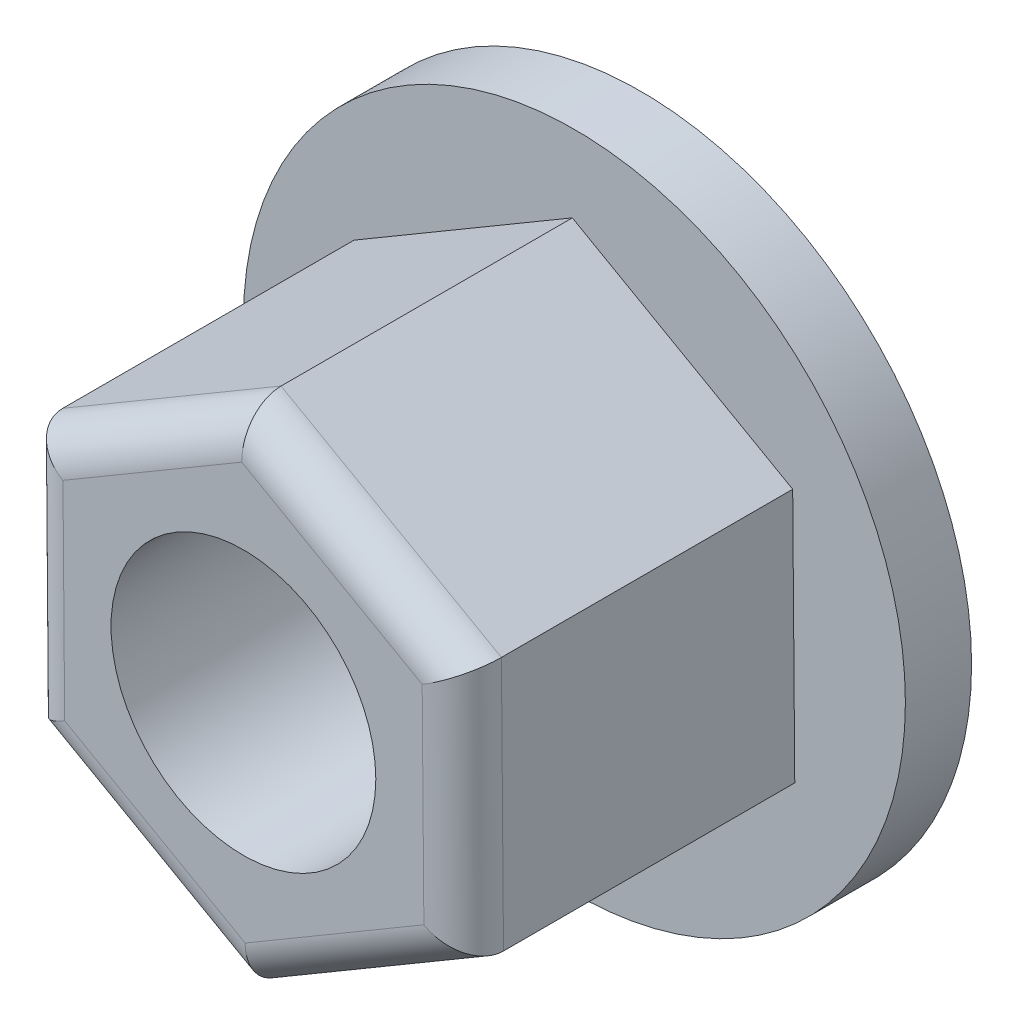
ISO-10303-21;
HEADER;
FILE_DESCRIPTION(('STEP AP214'),'2;1');
FILE_NAME('part.step','',(''),(''),'','','');
FILE_SCHEMA(('AUTOMOTIVE_DESIGN { 1 0 10303 214 1 1 1 1 }'));
ENDSEC;
DATA;
#1=APPLICATION_CONTEXT('core data for automotive mechanical design processes');
#2=APPLICATION_PROTOCOL_DEFINITION('international standard','automotive_design',2000,#1);
#3=PRODUCT_CONTEXT('',#1,'mechanical');
#4=PRODUCT('Part','Part','',(#3));
#5=PRODUCT_RELATED_PRODUCT_CATEGORY('part','',(#4));
#6=PRODUCT_DEFINITION_FORMATION('','',#4);
#7=PRODUCT_DEFINITION_CONTEXT('part definition',#1,'design');
#8=PRODUCT_DEFINITION('design','',#6,#7);
#9=PRODUCT_DEFINITION_SHAPE('','',#8);
#10=(LENGTH_UNIT() NAMED_UNIT(*) SI_UNIT(.MILLI.,.METRE.));
#11=(NAMED_UNIT(*) PLANE_ANGLE_UNIT() SI_UNIT($,.RADIAN.));
#12=(NAMED_UNIT(*) SI_UNIT($,.STERADIAN.) SOLID_ANGLE_UNIT());
#13=UNCERTAINTY_MEASURE_WITH_UNIT(LENGTH_MEASURE(1.E-05),#10,'distance_accuracy_value','');
#14=(GEOMETRIC_REPRESENTATION_CONTEXT(3) GLOBAL_UNCERTAINTY_ASSIGNED_CONTEXT((#13)) GLOBAL_UNIT_ASSIGNED_CONTEXT((#10,
#11,#12)) REPRESENTATION_CONTEXT('',''));
#15=CARTESIAN_POINT('',(0.,0.,0.));
#16=DIRECTION('',(0.,0.,1.));
#17=DIRECTION('',(1.,0.,0.));
#18=AXIS2_PLACEMENT_3D('',#15,#16,#17);
#19=CARTESIAN_POINT('',(0.,0.,5.));
#20=DIRECTION('',(0.,0.,-1.));
#21=DIRECTION('',(-1.,0.,0.));
#22=AXIS2_PLACEMENT_3D('',#19,#20,#21);
#23=CYLINDRICAL_SURFACE('',#22,25.);
#24=CARTESIAN_POINT('',(0.,0.,5.));
#25=DIRECTION('',(0.,0.,1.));
#26=DIRECTION('',(1.,0.,0.));
#27=AXIS2_PLACEMENT_3D('',#24,#25,#26);
#28=CIRCLE('',#27,25.);
#29=CARTESIAN_POINT('',(25.,0.,5.));
#30=VERTEX_POINT('',#29);
#31=EDGE_CURVE('E165',#30,#30,#28,.T.);
#32=ORIENTED_EDGE('',*,*,#31,.F.);
#33=EDGE_LOOP('',(#32));
#34=FACE_BOUND('',#33,.T.);
#35=CARTESIAN_POINT('',(0.,0.,0.));
#36=DIRECTION('',(0.,0.,1.));
#37=DIRECTION('',(1.,0.,0.));
#38=AXIS2_PLACEMENT_3D('',#35,#36,#37);
#39=CIRCLE('',#38,25.);
#40=CARTESIAN_POINT('',(25.,0.,0.));
#41=VERTEX_POINT('',#40);
#42=EDGE_CURVE('E164',#41,#41,#39,.T.);
#43=ORIENTED_EDGE('',*,*,#42,.T.);
#44=EDGE_LOOP('',(#43));
#45=FACE_BOUND('',#44,.T.);
#46=ADVANCED_FACE('F39',(#34,#45),#23,.T.);
#47=CARTESIAN_POINT('',(0.,0.,5.));
#48=DIRECTION('',(0.,0.,1.));
#49=DIRECTION('',(1.,0.,0.));
#50=AXIS2_PLACEMENT_3D('',#47,#48,#49);
#51=PLANE('',#50);
#52=DIRECTION('',(0.861883033836159,0.507107124762981,0.));
#53=VECTOR('',#52,1.);
#54=CARTESIAN_POINT('',(0.15735845395707,-19.1284386722688,5.));
#55=LINE('',#54,#53);
#56=CARTESIAN_POINT('',(0.15735845395707,-19.1284386722688,5.));
#57=VERTEX_POINT('',#56);
#58=CARTESIAN_POINT('',(16.644393051896,-9.42794291750733,5.));
#59=VERTEX_POINT('',#58);
#60=EDGE_CURVE('E135',#57,#59,#55,.T.);
#61=ORIENTED_EDGE('',*,*,#60,.F.);
#62=DIRECTION('',(0.870109169402906,-0.492859040011426,0.));
#63=VECTOR('',#62,1.);
#64=CARTESIAN_POINT('',(-16.4870345979389,-9.70049575476147,5.));
#65=LINE('',#64,#63);
#66=CARTESIAN_POINT('',(-16.4870345979389,-9.70049575476147,5.));
#67=VERTEX_POINT('',#66);
#68=EDGE_CURVE('E147',#67,#57,#65,.T.);
#69=ORIENTED_EDGE('',*,*,#68,.F.);
#70=DIRECTION('',(0.00822613556674694,-0.999966164774408,0.));
#71=VECTOR('',#70,1.);
#72=CARTESIAN_POINT('',(-16.644393051896,9.42794291750733,5.));
#73=LINE('',#72,#71);
#74=CARTESIAN_POINT('',(-16.644393051896,9.42794291750733,5.));
#75=VERTEX_POINT('',#74);
#76=EDGE_CURVE('E143',#75,#67,#73,.T.);
#77=ORIENTED_EDGE('',*,*,#76,.F.);
#78=DIRECTION('',(-0.861883033836159,-0.507107124762981,0.));
#79=VECTOR('',#78,1.);
#80=CARTESIAN_POINT('',(-0.15735845395707,19.1284386722688,5.));
#81=LINE('',#80,#79);
#82=CARTESIAN_POINT('',(-0.15735845395707,19.1284386722688,5.));
#83=VERTEX_POINT('',#82);
#84=EDGE_CURVE('E130',#83,#75,#81,.T.);
#85=ORIENTED_EDGE('',*,*,#84,.F.);
#86=DIRECTION('',(-0.870109169402906,0.492859040011426,0.));
#87=VECTOR('',#86,1.);
#88=CARTESIAN_POINT('',(16.4870345979389,9.70049575476148,5.));
#89=LINE('',#88,#87);
#90=CARTESIAN_POINT('',(16.4870345979389,9.70049575476148,5.));
#91=VERTEX_POINT('',#90);
#92=EDGE_CURVE('E113',#91,#83,#89,.T.);
#93=ORIENTED_EDGE('',*,*,#92,.F.);
#94=DIRECTION('',(-0.0082261355667464,0.999966164774407,0.));
#95=VECTOR('',#94,1.);
#96=CARTESIAN_POINT('',(16.644393051896,-9.42794291750733,5.));
#97=LINE('',#96,#95);
#98=EDGE_CURVE('E126',#59,#91,#97,.T.);
#99=ORIENTED_EDGE('',*,*,#98,.F.);
#100=EDGE_LOOP('',(#61,#69,#77,#85,#93,#99));
#101=FACE_BOUND('',#100,.T.);
#102=ORIENTED_EDGE('',*,*,#31,.T.);
#103=EDGE_LOOP('',(#102));
#104=FACE_BOUND('',#103,.T.);
#105=ADVANCED_FACE('F124',(#101,#104),#51,.T.);
#106=CARTESIAN_POINT('',(0.,0.,0.));
#107=DIRECTION('',(0.,0.,1.));
#108=DIRECTION('',(1.,0.,0.));
#109=AXIS2_PLACEMENT_3D('',#106,#107,#108);
#110=PLANE('',#109);
#111=CARTESIAN_POINT('',(0.,0.,0.));
#112=DIRECTION('',(0.,0.,1.));
#113=DIRECTION('',(1.,0.,0.));
#114=AXIS2_PLACEMENT_3D('',#111,#112,#113);
#115=CIRCLE('',#114,10.);
#116=CARTESIAN_POINT('',(10.,0.,0.));
#117=VERTEX_POINT('',#116);
#118=EDGE_CURVE('E209',#117,#117,#115,.T.);
#119=ORIENTED_EDGE('',*,*,#118,.T.);
#120=EDGE_LOOP('',(#119));
#121=FACE_BOUND('',#120,.T.);
#122=ORIENTED_EDGE('',*,*,#42,.F.);
#123=EDGE_LOOP('',(#122));
#124=FACE_BOUND('',#123,.T.);
#125=ADVANCED_FACE('F276',(#121,#124),#110,.F.);
#126=CARTESIAN_POINT('',(0.15735845395707,-19.1284386722688,30.));
#127=DIRECTION('',(-0.507107124762981,0.861883033836159,0.));
#128=DIRECTION('',(-0.861883033836159,-0.507107124762981,0.));
#129=AXIS2_PLACEMENT_3D('',#126,#127,#128);
#130=PLANE('',#129);
#131=DIRECTION('',(0.,0.,-1.));
#132=VECTOR('',#131,1.);
#133=CARTESIAN_POINT('',(16.644393051896,-9.42794291750733,30.));
#134=LINE('',#133,#132);
#135=CARTESIAN_POINT('',(16.644393051896,-9.42794291750733,27.));
#136=VERTEX_POINT('',#135);
#137=EDGE_CURVE('E117',#136,#59,#134,.T.);
#138=ORIENTED_EDGE('',*,*,#137,.F.);
#139=DIRECTION('',(0.861883033836159,0.507107124762981,0.));
#140=VECTOR('',#139,1.);
#141=CARTESIAN_POINT('',(0.157358453957069,-19.1284386722688,27.));
#142=LINE('',#141,#140);
#143=CARTESIAN_POINT('',(0.15735845395707,-19.1284386722688,27.));
#144=VERTEX_POINT('',#143);
#145=EDGE_CURVE('E11',#136,#144,#142,.F.);
#146=ORIENTED_EDGE('',*,*,#145,.T.);
#147=DIRECTION('',(0.,0.,-1.));
#148=VECTOR('',#147,1.);
#149=CARTESIAN_POINT('',(0.15735845395707,-19.1284386722688,30.));
#150=LINE('',#149,#148);
#151=EDGE_CURVE('E151',#144,#57,#150,.T.);
#152=ORIENTED_EDGE('',*,*,#151,.T.);
#153=ORIENTED_EDGE('',*,*,#60,.T.);
#154=EDGE_LOOP('',(#138,#146,#152,#153));
#155=FACE_BOUND('',#154,.T.);
#156=ADVANCED_FACE('F243',(#155),#130,.F.);
#157=CARTESIAN_POINT('',(16.644393051896,-9.42794291750733,30.));
#158=DIRECTION('',(-0.999966164774407,-0.0082261355667464,0.));
#159=DIRECTION('',(0.0082261355667464,-0.999966164774408,0.));
#160=AXIS2_PLACEMENT_3D('',#157,#158,#159);
#161=PLANE('',#160);
#162=DIRECTION('',(0.,0.,-1.));
#163=VECTOR('',#162,1.);
#164=CARTESIAN_POINT('',(16.4870345979389,9.70049575476148,30.));
#165=LINE('',#164,#163);
#166=CARTESIAN_POINT('',(16.4870345979389,9.70049575476148,27.));
#167=VERTEX_POINT('',#166);
#168=EDGE_CURVE('E110',#167,#91,#165,.T.);
#169=ORIENTED_EDGE('',*,*,#168,.F.);
#170=DIRECTION('',(-0.0082261355667464,0.999966164774408,0.));
#171=VECTOR('',#170,1.);
#172=CARTESIAN_POINT('',(16.644393051896,-9.42794291750733,27.));
#173=LINE('',#172,#171);
#174=EDGE_CURVE('E49',#167,#136,#173,.F.);
#175=ORIENTED_EDGE('',*,*,#174,.T.);
#176=ORIENTED_EDGE('',*,*,#137,.T.);
#177=ORIENTED_EDGE('',*,*,#98,.T.);
#178=EDGE_LOOP('',(#169,#175,#176,#177));
#179=FACE_BOUND('',#178,.T.);
#180=ADVANCED_FACE('F133',(#179),#161,.F.);
#181=CARTESIAN_POINT('',(16.4870345979389,9.70049575476148,30.));
#182=DIRECTION('',(-0.492859040011426,-0.870109169402906,0.));
#183=DIRECTION('',(0.870109169402906,-0.492859040011426,0.));
#184=AXIS2_PLACEMENT_3D('',#181,#182,#183);
#185=PLANE('',#184);
#186=DIRECTION('',(0.,0.,-1.));
#187=VECTOR('',#186,1.);
#188=CARTESIAN_POINT('',(-0.15735845395707,19.1284386722688,30.));
#189=LINE('',#188,#187);
#190=CARTESIAN_POINT('',(-0.15735845395707,19.1284386722688,27.));
#191=VERTEX_POINT('',#190);
#192=EDGE_CURVE('E118',#191,#83,#189,.T.);
#193=ORIENTED_EDGE('',*,*,#192,.F.);
#194=DIRECTION('',(-0.870109169402906,0.492859040011426,0.));
#195=VECTOR('',#194,1.);
#196=CARTESIAN_POINT('',(16.4870345979389,9.70049575476148,27.));
#197=LINE('',#196,#195);
#198=EDGE_CURVE('E64',#191,#167,#197,.F.);
#199=ORIENTED_EDGE('',*,*,#198,.T.);
#200=ORIENTED_EDGE('',*,*,#168,.T.);
#201=ORIENTED_EDGE('',*,*,#92,.T.);
#202=EDGE_LOOP('',(#193,#199,#200,#201));
#203=FACE_BOUND('',#202,.T.);
#204=ADVANCED_FACE('F112',(#203),#185,.F.);
#205=CARTESIAN_POINT('',(-0.15735845395707,19.1284386722688,30.));
#206=DIRECTION('',(0.507107124762981,-0.861883033836159,0.));
#207=DIRECTION('',(0.861883033836159,0.507107124762981,0.));
#208=AXIS2_PLACEMENT_3D('',#205,#206,#207);
#209=PLANE('',#208);
#210=DIRECTION('',(0.,0.,-1.));
#211=VECTOR('',#210,1.);
#212=CARTESIAN_POINT('',(-16.644393051896,9.42794291750733,30.));
#213=LINE('',#212,#211);
#214=CARTESIAN_POINT('',(-16.644393051896,9.42794291750733,27.));
#215=VERTEX_POINT('',#214);
#216=EDGE_CURVE('E157',#215,#75,#213,.T.);
#217=ORIENTED_EDGE('',*,*,#216,.F.);
#218=DIRECTION('',(-0.861883033836159,-0.507107124762981,0.));
#219=VECTOR('',#218,1.);
#220=CARTESIAN_POINT('',(-0.157358453957069,19.1284386722688,27.));
#221=LINE('',#220,#219);
#222=EDGE_CURVE('E198',#215,#191,#221,.F.);
#223=ORIENTED_EDGE('',*,*,#222,.T.);
#224=ORIENTED_EDGE('',*,*,#192,.T.);
#225=ORIENTED_EDGE('',*,*,#84,.T.);
#226=EDGE_LOOP('',(#217,#223,#224,#225));
#227=FACE_BOUND('',#226,.T.);
#228=ADVANCED_FACE('F261',(#227),#209,.F.);
#229=CARTESIAN_POINT('',(-16.644393051896,9.42794291750733,30.));
#230=DIRECTION('',(0.999966164774407,0.00822613556674694,0.));
#231=DIRECTION('',(-0.00822613556674695,0.999966164774408,0.));
#232=AXIS2_PLACEMENT_3D('',#229,#230,#231);
#233=PLANE('',#232);
#234=DIRECTION('',(0.,0.,-1.));
#235=VECTOR('',#234,1.);
#236=CARTESIAN_POINT('',(-16.4870345979389,-9.70049575476147,30.));
#237=LINE('',#236,#235);
#238=CARTESIAN_POINT('',(-16.4870345979389,-9.70049575476147,27.));
#239=VERTEX_POINT('',#238);
#240=EDGE_CURVE('E154',#239,#67,#237,.T.);
#241=ORIENTED_EDGE('',*,*,#240,.F.);
#242=DIRECTION('',(0.00822613556674695,-0.999966164774408,0.));
#243=VECTOR('',#242,1.);
#244=CARTESIAN_POINT('',(-16.644393051896,9.42794291750733,27.));
#245=LINE('',#244,#243);
#246=EDGE_CURVE('E195',#239,#215,#245,.F.);
#247=ORIENTED_EDGE('',*,*,#246,.T.);
#248=ORIENTED_EDGE('',*,*,#216,.T.);
#249=ORIENTED_EDGE('',*,*,#76,.T.);
#250=EDGE_LOOP('',(#241,#247,#248,#249));
#251=FACE_BOUND('',#250,.T.);
#252=ADVANCED_FACE('F259',(#251),#233,.F.);
#253=CARTESIAN_POINT('',(-16.4870345979389,-9.70049575476147,30.));
#254=DIRECTION('',(0.492859040011426,0.870109169402906,0.));
#255=DIRECTION('',(-0.870109169402906,0.492859040011426,0.));
#256=AXIS2_PLACEMENT_3D('',#253,#254,#255);
#257=PLANE('',#256);
#258=ORIENTED_EDGE('',*,*,#151,.F.);
#259=DIRECTION('',(0.870109169402906,-0.492859040011426,0.));
#260=VECTOR('',#259,1.);
#261=CARTESIAN_POINT('',(-16.4870345979389,-9.70049575476147,27.));
#262=LINE('',#261,#260);
#263=EDGE_CURVE('E191',#144,#239,#262,.F.);
#264=ORIENTED_EDGE('',*,*,#263,.T.);
#265=ORIENTED_EDGE('',*,*,#240,.T.);
#266=ORIENTED_EDGE('',*,*,#68,.T.);
#267=EDGE_LOOP('',(#258,#264,#265,#266));
#268=FACE_BOUND('',#267,.T.);
#269=ADVANCED_FACE('F246',(#268),#257,.F.);
#270=CARTESIAN_POINT('',(0.,0.,30.));
#271=DIRECTION('',(0.,0.,1.));
#272=DIRECTION('',(1.,0.,0.));
#273=AXIS2_PLACEMENT_3D('',#270,#271,#272);
#274=PLANE('',#273);
#275=CARTESIAN_POINT('',(0.,0.,30.));
#276=DIRECTION('',(0.,0.,1.));
#277=DIRECTION('',(1.,0.,0.));
#278=AXIS2_PLACEMENT_3D('',#275,#276,#277);
#279=CIRCLE('',#278,10.);
#280=CARTESIAN_POINT('',(10.,0.,30.));
#281=VERTEX_POINT('',#280);
#282=EDGE_CURVE('E315',#281,#281,#279,.T.);
#283=ORIENTED_EDGE('',*,*,#282,.F.);
#284=EDGE_LOOP('',(#283));
#285=FACE_BOUND('',#284,.T.);
#286=DIRECTION('',(0.00822613556674695,-0.999966164774408,0.));
#287=VECTOR('',#286,1.);
#288=CARTESIAN_POINT('',(-13.4871361036157,-9.67581734806124,30.));
#289=LINE('',#288,#287);
#290=CARTESIAN_POINT('',(-13.6302464728212,7.72062912096851,30.));
#291=VERTEX_POINT('',#290);
#292=CARTESIAN_POINT('',(-13.5013841883673,-7.94382514482217,30.));
#293=VERTEX_POINT('',#292);
#294=EDGE_CURVE('E184',#291,#293,#289,.T.);
#295=ORIENTED_EDGE('',*,*,#294,.T.);
#296=DIRECTION('',(0.870109169402906,-0.492859040011426,0.));
#297=VECTOR('',#296,1.);
#298=CARTESIAN_POINT('',(1.63593557399135,-16.5181111640601,30.));
#299=LINE('',#298,#297);
#300=CARTESIAN_POINT('',(0.128862284453957,-15.6644542657907,30.));
#301=VERTEX_POINT('',#300);
#302=EDGE_CURVE('E187',#293,#301,#299,.T.);
#303=ORIENTED_EDGE('',*,*,#302,.T.);
#304=DIRECTION('',(0.861883033836159,0.507107124762981,0.));
#305=VECTOR('',#304,1.);
#306=CARTESIAN_POINT('',(15.1230716776071,-6.84229381599885,30.));
#307=LINE('',#306,#305);
#308=CARTESIAN_POINT('',(13.6302464728212,-7.72062912096851,30.));
#309=VERTEX_POINT('',#308);
#310=EDGE_CURVE('E169',#301,#309,#307,.T.);
#311=ORIENTED_EDGE('',*,*,#310,.T.);
#312=DIRECTION('',(-0.0082261355667464,0.999966164774408,0.));
#313=VECTOR('',#312,1.);
#314=CARTESIAN_POINT('',(13.4871361036157,9.67581734806124,30.));
#315=LINE('',#314,#313);
#316=CARTESIAN_POINT('',(13.5013841883673,7.94382514482218,30.));
#317=VERTEX_POINT('',#316);
#318=EDGE_CURVE('E175',#309,#317,#315,.T.);
#319=ORIENTED_EDGE('',*,*,#318,.T.);
#320=DIRECTION('',(-0.870109169402906,0.492859040011426,0.));
#321=VECTOR('',#320,1.);
#322=CARTESIAN_POINT('',(-1.63593557399135,16.5181111640601,30.));
#323=LINE('',#322,#321);
#324=CARTESIAN_POINT('',(-0.128862284453954,15.6644542657907,30.));
#325=VERTEX_POINT('',#324);
#326=EDGE_CURVE('E178',#317,#325,#323,.T.);
#327=ORIENTED_EDGE('',*,*,#326,.T.);
#328=DIRECTION('',(-0.861883033836159,-0.507107124762981,0.));
#329=VECTOR('',#328,1.);
#330=CARTESIAN_POINT('',(-15.1230716776071,6.84229381599885,30.));
#331=LINE('',#330,#329);
#332=EDGE_CURVE('E181',#325,#291,#331,.T.);
#333=ORIENTED_EDGE('',*,*,#332,.T.);
#334=EDGE_LOOP('',(#295,#303,#311,#319,#327,#333));
#335=FACE_BOUND('',#334,.T.);
#336=ADVANCED_FACE('F294',(#285,#335),#274,.T.);
#337=CARTESIAN_POINT('',(6.68626095195665,11.8041397053064,27.));
#338=DIRECTION('',(0.870109169402906,-0.492859040011426,0.));
#339=DIRECTION('',(0.492859040011426,0.870109169402906,0.));
#340=AXIS2_PLACEMENT_3D('',#337,#338,#339);
#341=CYLINDRICAL_SURFACE('',#340,3.);
#342=CARTESIAN_POINT('',(13.5013841883673,7.94382514482218,27.));
#343=DIRECTION('',(0.507107124762981,-0.861883033836159,0.));
#344=DIRECTION('',(-0.861883033836159,-0.507107124762981,0.));
#345=AXIS2_PLACEMENT_3D('',#342,#343,#344);
#346=ELLIPSE('',#345,3.46410161513775,3.);
#347=EDGE_CURVE('E219',#167,#317,#346,.T.);
#348=ORIENTED_EDGE('',*,*,#347,.F.);
#349=ORIENTED_EDGE('',*,*,#198,.F.);
#350=CARTESIAN_POINT('',(-0.128862284453955,15.6644542657907,27.));
#351=DIRECTION('',(0.999966164774408,0.00822613556674681,0.));
#352=DIRECTION('',(0.0082261355667469,-0.999966164774408,0.));
#353=AXIS2_PLACEMENT_3D('',#350,#351,#352);
#354=ELLIPSE('',#353,3.46410161513775,3.);
#355=EDGE_CURVE('E43',#325,#191,#354,.F.);
#356=ORIENTED_EDGE('',*,*,#355,.F.);
#357=ORIENTED_EDGE('',*,*,#326,.F.);
#358=EDGE_LOOP('',(#348,#349,#356,#357));
#359=FACE_BOUND('',#358,.T.);
#360=ADVANCED_FACE('F41',(#359),#341,.T.);
#361=CARTESIAN_POINT('',(-6.87955437863759,11.6925416933796,27.));
#362=DIRECTION('',(0.861883033836159,0.507107124762981,0.));
#363=DIRECTION('',(-0.507107124762981,0.861883033836159,0.));
#364=AXIS2_PLACEMENT_3D('',#361,#362,#363);
#365=CYLINDRICAL_SURFACE('',#364,3.);
#366=ORIENTED_EDGE('',*,*,#355,.T.);
#367=ORIENTED_EDGE('',*,*,#222,.F.);
#368=CARTESIAN_POINT('',(-13.6302464728212,7.72062912096851,27.));
#369=DIRECTION('',(0.492859040011426,0.870109169402906,0.));
#370=DIRECTION('',(0.870109169402906,-0.492859040011426,0.));
#371=AXIS2_PLACEMENT_3D('',#368,#369,#370);
#372=ELLIPSE('',#371,3.46410161513775,3.);
#373=EDGE_CURVE('E216',#291,#215,#372,.F.);
#374=ORIENTED_EDGE('',*,*,#373,.F.);
#375=ORIENTED_EDGE('',*,*,#332,.F.);
#376=EDGE_LOOP('',(#366,#367,#374,#375));
#377=FACE_BOUND('',#376,.T.);
#378=ADVANCED_FACE('F230',(#377),#365,.T.);
#379=CARTESIAN_POINT('',(13.5658153305942,0.111598011926824,27.));
#380=DIRECTION('',(0.0082261355667464,-0.999966164774408,0.));
#381=DIRECTION('',(0.999966164774407,0.0082261355667464,0.));
#382=AXIS2_PLACEMENT_3D('',#379,#380,#381);
#383=CYLINDRICAL_SURFACE('',#382,3.);
#384=ORIENTED_EDGE('',*,*,#347,.T.);
#385=ORIENTED_EDGE('',*,*,#318,.F.);
#386=CARTESIAN_POINT('',(13.6302464728212,-7.72062912096851,27.));
#387=DIRECTION('',(-0.492859040011426,-0.870109169402906,0.));
#388=DIRECTION('',(-0.870109169402906,0.492859040011427,0.));
#389=AXIS2_PLACEMENT_3D('',#386,#387,#388);
#390=ELLIPSE('',#389,3.46410161513775,3.);
#391=EDGE_CURVE('E212',#136,#309,#390,.T.);
#392=ORIENTED_EDGE('',*,*,#391,.F.);
#393=ORIENTED_EDGE('',*,*,#174,.F.);
#394=EDGE_LOOP('',(#384,#385,#392,#393));
#395=FACE_BOUND('',#394,.T.);
#396=ADVANCED_FACE('F235',(#395),#383,.T.);
#397=CARTESIAN_POINT('',(-13.5658153305942,-0.111598011926831,27.));
#398=DIRECTION('',(-0.00822613556674695,0.999966164774408,0.));
#399=DIRECTION('',(-0.999966164774407,-0.00822613556674694,0.));
#400=AXIS2_PLACEMENT_3D('',#397,#398,#399);
#401=CYLINDRICAL_SURFACE('',#400,3.);
#402=ORIENTED_EDGE('',*,*,#373,.T.);
#403=ORIENTED_EDGE('',*,*,#246,.F.);
#404=CARTESIAN_POINT('',(-13.5013841883673,-7.94382514482217,27.));
#405=DIRECTION('',(-0.507107124762981,0.861883033836159,0.));
#406=DIRECTION('',(0.861883033836159,0.507107124762981,0.));
#407=AXIS2_PLACEMENT_3D('',#404,#405,#406);
#408=ELLIPSE('',#407,3.46410161513775,3.);
#409=EDGE_CURVE('E208',#293,#239,#408,.F.);
#410=ORIENTED_EDGE('',*,*,#409,.F.);
#411=ORIENTED_EDGE('',*,*,#294,.F.);
#412=EDGE_LOOP('',(#402,#403,#410,#411));
#413=FACE_BOUND('',#412,.T.);
#414=ADVANCED_FACE('F256',(#413),#401,.T.);
#415=CARTESIAN_POINT('',(6.87955437863759,-11.6925416933796,27.));
#416=DIRECTION('',(-0.861883033836159,-0.507107124762981,0.));
#417=DIRECTION('',(0.507107124762981,-0.861883033836159,0.));
#418=AXIS2_PLACEMENT_3D('',#415,#416,#417);
#419=CYLINDRICAL_SURFACE('',#418,3.);
#420=ORIENTED_EDGE('',*,*,#391,.T.);
#421=ORIENTED_EDGE('',*,*,#310,.F.);
#422=CARTESIAN_POINT('',(0.128862284453961,-15.6644542657907,27.));
#423=DIRECTION('',(-0.999966164774408,-0.00822613556674684,0.));
#424=DIRECTION('',(0.0082261355667469,-0.999966164774408,0.));
#425=AXIS2_PLACEMENT_3D('',#422,#423,#424);
#426=ELLIPSE('',#425,3.46410161513775,3.);
#427=EDGE_CURVE('E205',#144,#301,#426,.T.);
#428=ORIENTED_EDGE('',*,*,#427,.F.);
#429=ORIENTED_EDGE('',*,*,#145,.F.);
#430=EDGE_LOOP('',(#420,#421,#428,#429));
#431=FACE_BOUND('',#430,.T.);
#432=ADVANCED_FACE('F240',(#431),#419,.T.);
#433=CARTESIAN_POINT('',(-6.68626095195665,-11.8041397053064,27.));
#434=DIRECTION('',(-0.870109169402906,0.492859040011426,0.));
#435=DIRECTION('',(-0.492859040011426,-0.870109169402906,0.));
#436=AXIS2_PLACEMENT_3D('',#433,#434,#435);
#437=CYLINDRICAL_SURFACE('',#436,3.);
#438=ORIENTED_EDGE('',*,*,#409,.T.);
#439=ORIENTED_EDGE('',*,*,#263,.F.);
#440=ORIENTED_EDGE('',*,*,#427,.T.);
#441=ORIENTED_EDGE('',*,*,#302,.F.);
#442=EDGE_LOOP('',(#438,#439,#440,#441));
#443=FACE_BOUND('',#442,.T.);
#444=ADVANCED_FACE('F250',(#443),#437,.T.);
#445=CARTESIAN_POINT('',(0.,0.,0.));
#446=DIRECTION('',(0.,0.,1.));
#447=DIRECTION('',(1.,0.,0.));
#448=AXIS2_PLACEMENT_3D('',#445,#446,#447);
#449=CYLINDRICAL_SURFACE('',#448,10.);
#450=ORIENTED_EDGE('',*,*,#118,.F.);
#451=EDGE_LOOP('',(#450));
#452=FACE_BOUND('',#451,.T.);
#453=ORIENTED_EDGE('',*,*,#282,.T.);
#454=EDGE_LOOP('',(#453));
#455=FACE_BOUND('',#454,.T.);
#456=ADVANCED_FACE('F284',(#452,#455),#449,.F.);
#457=CLOSED_SHELL('',(#46,#105,#125,#156,#180,#204,#228,#252,#269,#336,#360,#378,#396,#414,#432,
#444,#456));
#458=MANIFOLD_SOLID_BREP('B2',#457);
#459=ADVANCED_BREP_SHAPE_REPRESENTATION('',(#18,#458),#14);
#460=SHAPE_DEFINITION_REPRESENTATION(#9,#459);
ENDSEC;
END-ISO-10303-21;
